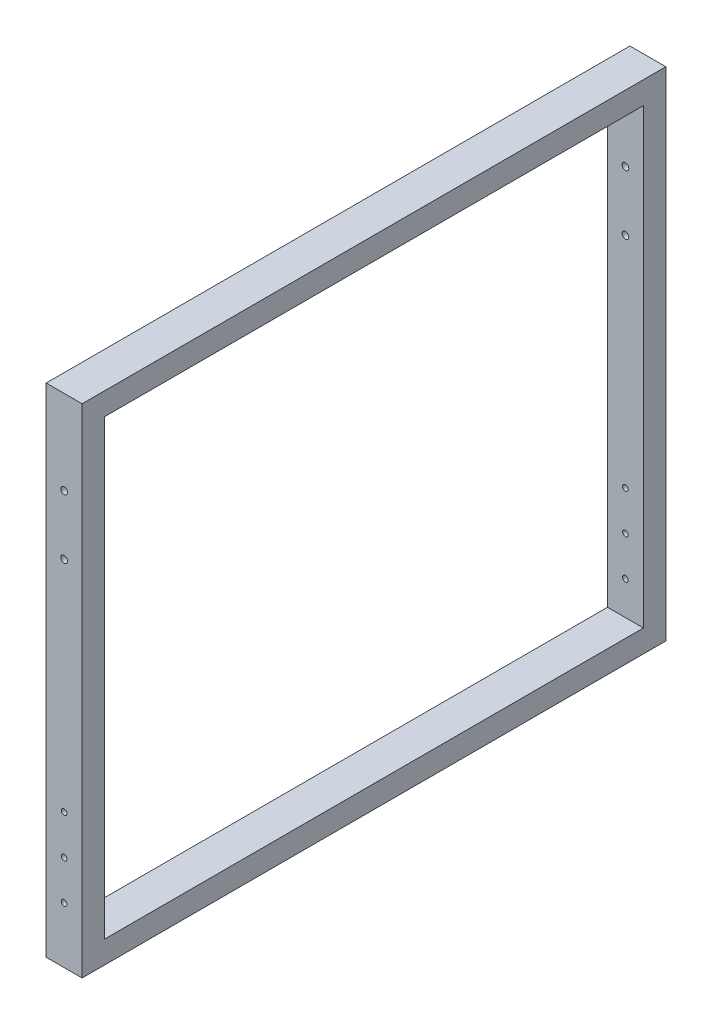
ISO-10303-21;
HEADER;
FILE_DESCRIPTION(('STEP AP214'),'2;1');
FILE_NAME('part.step','',(''),(''),'','','');
FILE_SCHEMA(('AUTOMOTIVE_DESIGN { 1 0 10303 214 1 1 1 1 }'));
ENDSEC;
DATA;
#1=APPLICATION_CONTEXT('core data for automotive mechanical design processes');
#2=APPLICATION_PROTOCOL_DEFINITION('international standard','automotive_design',2000,#1);
#3=PRODUCT_CONTEXT('',#1,'mechanical');
#4=PRODUCT('Part','Part','',(#3));
#5=PRODUCT_RELATED_PRODUCT_CATEGORY('part','',(#4));
#6=PRODUCT_DEFINITION_FORMATION('','',#4);
#7=PRODUCT_DEFINITION_CONTEXT('part definition',#1,'design');
#8=PRODUCT_DEFINITION('design','',#6,#7);
#9=PRODUCT_DEFINITION_SHAPE('','',#8);
#10=(LENGTH_UNIT() NAMED_UNIT(*) SI_UNIT(.MILLI.,.METRE.));
#11=(NAMED_UNIT(*) PLANE_ANGLE_UNIT() SI_UNIT($,.RADIAN.));
#12=(NAMED_UNIT(*) SI_UNIT($,.STERADIAN.) SOLID_ANGLE_UNIT());
#13=UNCERTAINTY_MEASURE_WITH_UNIT(LENGTH_MEASURE(1.E-05),#10,'distance_accuracy_value','');
#14=(GEOMETRIC_REPRESENTATION_CONTEXT(3) GLOBAL_UNCERTAINTY_ASSIGNED_CONTEXT((#13)) GLOBAL_UNIT_ASSIGNED_CONTEXT((#10,
#11,#12)) REPRESENTATION_CONTEXT('',''));
#15=CARTESIAN_POINT('',(0.,0.,0.));
#16=DIRECTION('',(0.,0.,1.));
#17=DIRECTION('',(1.,0.,0.));
#18=AXIS2_PLACEMENT_3D('',#15,#16,#17);
#19=CARTESIAN_POINT('',(32.,0.,0.));
#20=DIRECTION('',(-1.,0.,0.));
#21=DIRECTION('',(0.,0.,1.));
#22=AXIS2_PLACEMENT_3D('',#19,#20,#21);
#23=PLANE('',#22);
#24=DIRECTION('',(0.,1.,0.));
#25=VECTOR('',#24,1.);
#26=CARTESIAN_POINT('',(32.,221.5,-260.));
#27=LINE('',#26,#25);
#28=CARTESIAN_POINT('',(32.,-221.5,-260.));
#29=VERTEX_POINT('',#28);
#30=CARTESIAN_POINT('',(32.,221.5,-260.));
#31=VERTEX_POINT('',#30);
#32=EDGE_CURVE('E162',#29,#31,#27,.T.);
#33=ORIENTED_EDGE('',*,*,#32,.T.);
#34=DIRECTION('',(0.,0.,1.));
#35=VECTOR('',#34,1.);
#36=CARTESIAN_POINT('',(32.,221.5,-260.));
#37=LINE('',#36,#35);
#38=CARTESIAN_POINT('',(32.,221.5,260.));
#39=VERTEX_POINT('',#38);
#40=EDGE_CURVE('E166',#31,#39,#37,.T.);
#41=ORIENTED_EDGE('',*,*,#40,.T.);
#42=DIRECTION('',(0.,-1.,0.));
#43=VECTOR('',#42,1.);
#44=CARTESIAN_POINT('',(32.,221.5,260.));
#45=LINE('',#44,#43);
#46=CARTESIAN_POINT('',(32.,-221.5,260.));
#47=VERTEX_POINT('',#46);
#48=EDGE_CURVE('E170',#39,#47,#45,.T.);
#49=ORIENTED_EDGE('',*,*,#48,.T.);
#50=DIRECTION('',(0.,0.,-1.));
#51=VECTOR('',#50,1.);
#52=CARTESIAN_POINT('',(32.,-221.5,-260.));
#53=LINE('',#52,#51);
#54=EDGE_CURVE('E173',#47,#29,#53,.T.);
#55=ORIENTED_EDGE('',*,*,#54,.T.);
#56=EDGE_LOOP('',(#33,#41,#49,#55));
#57=FACE_BOUND('',#56,.T.);
#58=DIRECTION('',(0.,1.,0.));
#59=VECTOR('',#58,1.);
#60=CARTESIAN_POINT('',(32.,-201.5,-240.));
#61=LINE('',#60,#59);
#62=CARTESIAN_POINT('',(32.,-201.5,-240.));
#63=VERTEX_POINT('',#62);
#64=CARTESIAN_POINT('',(32.,201.5,-240.));
#65=VERTEX_POINT('',#64);
#66=EDGE_CURVE('E112',#63,#65,#61,.T.);
#67=ORIENTED_EDGE('',*,*,#66,.F.);
#68=DIRECTION('',(0.,0.,-1.));
#69=VECTOR('',#68,1.);
#70=CARTESIAN_POINT('',(32.,-201.5,240.));
#71=LINE('',#70,#69);
#72=CARTESIAN_POINT('',(32.,-201.5,240.));
#73=VERTEX_POINT('',#72);
#74=EDGE_CURVE('E138',#73,#63,#71,.T.);
#75=ORIENTED_EDGE('',*,*,#74,.F.);
#76=DIRECTION('',(0.,-1.,0.));
#77=VECTOR('',#76,1.);
#78=CARTESIAN_POINT('',(32.,-201.5,240.));
#79=LINE('',#78,#77);
#80=CARTESIAN_POINT('',(32.,201.5,240.));
#81=VERTEX_POINT('',#80);
#82=EDGE_CURVE('E134',#81,#73,#79,.T.);
#83=ORIENTED_EDGE('',*,*,#82,.F.);
#84=DIRECTION('',(0.,0.,1.));
#85=VECTOR('',#84,1.);
#86=CARTESIAN_POINT('',(32.,201.5,240.));
#87=LINE('',#86,#85);
#88=EDGE_CURVE('E121',#65,#81,#87,.T.);
#89=ORIENTED_EDGE('',*,*,#88,.F.);
#90=EDGE_LOOP('',(#67,#75,#83,#89));
#91=FACE_BOUND('',#90,.T.);
#92=ADVANCED_FACE('F44',(#57,#91),#23,.F.);
#93=CARTESIAN_POINT('',(0.,0.,0.));
#94=DIRECTION('',(-1.,0.,0.));
#95=DIRECTION('',(0.,0.,1.));
#96=AXIS2_PLACEMENT_3D('',#93,#94,#95);
#97=PLANE('',#96);
#98=DIRECTION('',(0.,1.,0.));
#99=VECTOR('',#98,1.);
#100=CARTESIAN_POINT('',(0.,221.5,-260.));
#101=LINE('',#100,#99);
#102=CARTESIAN_POINT('',(0.,-221.5,-260.));
#103=VERTEX_POINT('',#102);
#104=CARTESIAN_POINT('',(0.,221.5,-260.));
#105=VERTEX_POINT('',#104);
#106=EDGE_CURVE('E130',#103,#105,#101,.T.);
#107=ORIENTED_EDGE('',*,*,#106,.F.);
#108=DIRECTION('',(0.,0.,-1.));
#109=VECTOR('',#108,1.);
#110=CARTESIAN_POINT('',(0.,-221.5,-260.));
#111=LINE('',#110,#109);
#112=CARTESIAN_POINT('',(0.,-221.5,260.));
#113=VERTEX_POINT('',#112);
#114=EDGE_CURVE('E167',#113,#103,#111,.T.);
#115=ORIENTED_EDGE('',*,*,#114,.F.);
#116=DIRECTION('',(0.,-1.,0.));
#117=VECTOR('',#116,1.);
#118=CARTESIAN_POINT('',(0.,221.5,260.));
#119=LINE('',#118,#117);
#120=CARTESIAN_POINT('',(0.,221.5,260.));
#121=VERTEX_POINT('',#120);
#122=EDGE_CURVE('E183',#121,#113,#119,.T.);
#123=ORIENTED_EDGE('',*,*,#122,.F.);
#124=DIRECTION('',(0.,0.,1.));
#125=VECTOR('',#124,1.);
#126=CARTESIAN_POINT('',(0.,221.5,-260.));
#127=LINE('',#126,#125);
#128=EDGE_CURVE('E180',#105,#121,#127,.T.);
#129=ORIENTED_EDGE('',*,*,#128,.F.);
#130=EDGE_LOOP('',(#107,#115,#123,#129));
#131=FACE_BOUND('',#130,.T.);
#132=DIRECTION('',(0.,0.,-1.));
#133=VECTOR('',#132,1.);
#134=CARTESIAN_POINT('',(0.,-201.5,240.));
#135=LINE('',#134,#133);
#136=CARTESIAN_POINT('',(0.,-201.5,240.));
#137=VERTEX_POINT('',#136);
#138=CARTESIAN_POINT('',(0.,-201.5,-240.));
#139=VERTEX_POINT('',#138);
#140=EDGE_CURVE('E122',#137,#139,#135,.T.);
#141=ORIENTED_EDGE('',*,*,#140,.T.);
#142=DIRECTION('',(0.,1.,0.));
#143=VECTOR('',#142,1.);
#144=CARTESIAN_POINT('',(0.,-201.5,-240.));
#145=LINE('',#144,#143);
#146=CARTESIAN_POINT('',(0.,201.5,-240.));
#147=VERTEX_POINT('',#146);
#148=EDGE_CURVE('E70',#139,#147,#145,.T.);
#149=ORIENTED_EDGE('',*,*,#148,.T.);
#150=DIRECTION('',(0.,0.,1.));
#151=VECTOR('',#150,1.);
#152=CARTESIAN_POINT('',(0.,201.5,240.));
#153=LINE('',#152,#151);
#154=CARTESIAN_POINT('',(0.,201.5,240.));
#155=VERTEX_POINT('',#154);
#156=EDGE_CURVE('E128',#147,#155,#153,.T.);
#157=ORIENTED_EDGE('',*,*,#156,.T.);
#158=DIRECTION('',(0.,-1.,0.));
#159=VECTOR('',#158,1.);
#160=CARTESIAN_POINT('',(0.,-201.5,240.));
#161=LINE('',#160,#159);
#162=EDGE_CURVE('E149',#155,#137,#161,.T.);
#163=ORIENTED_EDGE('',*,*,#162,.T.);
#164=EDGE_LOOP('',(#141,#149,#157,#163));
#165=FACE_BOUND('',#164,.T.);
#166=ADVANCED_FACE('F299',(#131,#165),#97,.T.);
#167=CARTESIAN_POINT('',(32.,221.5,-260.));
#168=DIRECTION('',(0.,0.,1.));
#169=DIRECTION('',(1.,0.,0.));
#170=AXIS2_PLACEMENT_3D('',#167,#168,#169);
#171=PLANE('',#170);
#172=CARTESIAN_POINT('',(16.,146.5,-260.));
#173=DIRECTION('',(0.,0.,1.));
#174=DIRECTION('',(1.,0.,0.));
#175=AXIS2_PLACEMENT_3D('',#172,#173,#174);
#176=CIRCLE('',#175,3.);
#177=CARTESIAN_POINT('',(19.,146.5,-260.));
#178=VERTEX_POINT('',#177);
#179=EDGE_CURVE('E243',#178,#178,#176,.T.);
#180=ORIENTED_EDGE('',*,*,#179,.T.);
#181=EDGE_LOOP('',(#180));
#182=FACE_BOUND('',#181,.T.);
#183=CARTESIAN_POINT('',(16.,93.5,-260.));
#184=DIRECTION('',(0.,0.,1.));
#185=DIRECTION('',(1.,0.,0.));
#186=AXIS2_PLACEMENT_3D('',#183,#184,#185);
#187=CIRCLE('',#186,3.);
#188=CARTESIAN_POINT('',(19.,93.5,-260.));
#189=VERTEX_POINT('',#188);
#190=EDGE_CURVE('E229',#189,#189,#187,.T.);
#191=ORIENTED_EDGE('',*,*,#190,.T.);
#192=EDGE_LOOP('',(#191));
#193=FACE_BOUND('',#192,.T.);
#194=CARTESIAN_POINT('',(16.,-171.5,-260.));
#195=DIRECTION('',(0.,0.,1.));
#196=DIRECTION('',(1.,0.,0.));
#197=AXIS2_PLACEMENT_3D('',#194,#195,#196);
#198=CIRCLE('',#197,2.5);
#199=CARTESIAN_POINT('',(18.5,-171.5,-260.));
#200=VERTEX_POINT('',#199);
#201=EDGE_CURVE('E146',#200,#200,#198,.T.);
#202=ORIENTED_EDGE('',*,*,#201,.T.);
#203=EDGE_LOOP('',(#202));
#204=FACE_BOUND('',#203,.T.);
#205=CARTESIAN_POINT('',(16.,-136.5,-260.));
#206=DIRECTION('',(0.,0.,1.));
#207=DIRECTION('',(1.,0.,0.));
#208=AXIS2_PLACEMENT_3D('',#205,#206,#207);
#209=CIRCLE('',#208,2.5);
#210=CARTESIAN_POINT('',(18.5,-136.5,-260.));
#211=VERTEX_POINT('',#210);
#212=EDGE_CURVE('E214',#211,#211,#209,.T.);
#213=ORIENTED_EDGE('',*,*,#212,.T.);
#214=EDGE_LOOP('',(#213));
#215=FACE_BOUND('',#214,.T.);
#216=CARTESIAN_POINT('',(16.,-101.5,-260.));
#217=DIRECTION('',(0.,0.,1.));
#218=DIRECTION('',(1.,0.,0.));
#219=AXIS2_PLACEMENT_3D('',#216,#217,#218);
#220=CIRCLE('',#219,2.5);
#221=CARTESIAN_POINT('',(18.5,-101.5,-260.));
#222=VERTEX_POINT('',#221);
#223=EDGE_CURVE('E209',#222,#222,#220,.T.);
#224=ORIENTED_EDGE('',*,*,#223,.T.);
#225=EDGE_LOOP('',(#224));
#226=FACE_BOUND('',#225,.T.);
#227=ORIENTED_EDGE('',*,*,#106,.T.);
#228=DIRECTION('',(-1.,0.,0.));
#229=VECTOR('',#228,1.);
#230=CARTESIAN_POINT('',(32.,221.5,-260.));
#231=LINE('',#230,#229);
#232=EDGE_CURVE('E11',#31,#105,#231,.T.);
#233=ORIENTED_EDGE('',*,*,#232,.F.);
#234=ORIENTED_EDGE('',*,*,#32,.F.);
#235=DIRECTION('',(-1.,0.,0.));
#236=VECTOR('',#235,1.);
#237=CARTESIAN_POINT('',(32.,-221.5,-260.));
#238=LINE('',#237,#236);
#239=EDGE_CURVE('E176',#29,#103,#238,.T.);
#240=ORIENTED_EDGE('',*,*,#239,.T.);
#241=EDGE_LOOP('',(#227,#233,#234,#240));
#242=FACE_BOUND('',#241,.T.);
#243=ADVANCED_FACE('F46',(#182,#193,#204,#215,#226,#242),#171,.F.);
#244=CARTESIAN_POINT('',(32.,221.5,-260.));
#245=DIRECTION('',(0.,-1.,0.));
#246=DIRECTION('',(0.,0.,-1.));
#247=AXIS2_PLACEMENT_3D('',#244,#245,#246);
#248=PLANE('',#247);
#249=ORIENTED_EDGE('',*,*,#128,.T.);
#250=DIRECTION('',(-1.,0.,0.));
#251=VECTOR('',#250,1.);
#252=CARTESIAN_POINT('',(32.,221.5,260.));
#253=LINE('',#252,#251);
#254=EDGE_CURVE('E54',#39,#121,#253,.T.);
#255=ORIENTED_EDGE('',*,*,#254,.F.);
#256=ORIENTED_EDGE('',*,*,#40,.F.);
#257=ORIENTED_EDGE('',*,*,#232,.T.);
#258=EDGE_LOOP('',(#249,#255,#256,#257));
#259=FACE_BOUND('',#258,.T.);
#260=ADVANCED_FACE('F316',(#259),#248,.F.);
#261=CARTESIAN_POINT('',(32.,221.5,260.));
#262=DIRECTION('',(0.,0.,-1.));
#263=DIRECTION('',(-1.,0.,0.));
#264=AXIS2_PLACEMENT_3D('',#261,#262,#263);
#265=PLANE('',#264);
#266=CARTESIAN_POINT('',(16.,146.5,260.));
#267=DIRECTION('',(0.,0.,-1.));
#268=DIRECTION('',(-1.,0.,0.));
#269=AXIS2_PLACEMENT_3D('',#266,#267,#268);
#270=CIRCLE('',#269,3.);
#271=CARTESIAN_POINT('',(13.,146.5,260.));
#272=VERTEX_POINT('',#271);
#273=EDGE_CURVE('E239',#272,#272,#270,.T.);
#274=ORIENTED_EDGE('',*,*,#273,.T.);
#275=EDGE_LOOP('',(#274));
#276=FACE_BOUND('',#275,.T.);
#277=CARTESIAN_POINT('',(16.,93.5,260.));
#278=DIRECTION('',(0.,0.,-1.));
#279=DIRECTION('',(-1.,0.,0.));
#280=AXIS2_PLACEMENT_3D('',#277,#278,#279);
#281=CIRCLE('',#280,3.);
#282=CARTESIAN_POINT('',(13.,93.5,260.));
#283=VERTEX_POINT('',#282);
#284=EDGE_CURVE('E223',#283,#283,#281,.T.);
#285=ORIENTED_EDGE('',*,*,#284,.T.);
#286=EDGE_LOOP('',(#285));
#287=FACE_BOUND('',#286,.T.);
#288=CARTESIAN_POINT('',(16.,-171.5,260.));
#289=DIRECTION('',(0.,0.,1.));
#290=DIRECTION('',(1.,0.,0.));
#291=AXIS2_PLACEMENT_3D('',#288,#289,#290);
#292=CIRCLE('',#291,2.5);
#293=CARTESIAN_POINT('',(18.5,-171.5,260.));
#294=VERTEX_POINT('',#293);
#295=EDGE_CURVE('E203',#294,#294,#292,.T.);
#296=ORIENTED_EDGE('',*,*,#295,.F.);
#297=EDGE_LOOP('',(#296));
#298=FACE_BOUND('',#297,.T.);
#299=CARTESIAN_POINT('',(16.,-136.5,260.));
#300=DIRECTION('',(0.,0.,1.));
#301=DIRECTION('',(1.,0.,0.));
#302=AXIS2_PLACEMENT_3D('',#299,#300,#301);
#303=CIRCLE('',#302,2.5);
#304=CARTESIAN_POINT('',(18.5,-136.5,260.));
#305=VERTEX_POINT('',#304);
#306=EDGE_CURVE('E251',#305,#305,#303,.T.);
#307=ORIENTED_EDGE('',*,*,#306,.F.);
#308=EDGE_LOOP('',(#307));
#309=FACE_BOUND('',#308,.T.);
#310=CARTESIAN_POINT('',(16.,-101.5,260.));
#311=DIRECTION('',(0.,0.,1.));
#312=DIRECTION('',(1.,0.,0.));
#313=AXIS2_PLACEMENT_3D('',#310,#311,#312);
#314=CIRCLE('',#313,2.5);
#315=CARTESIAN_POINT('',(18.5,-101.5,260.));
#316=VERTEX_POINT('',#315);
#317=EDGE_CURVE('E247',#316,#316,#314,.T.);
#318=ORIENTED_EDGE('',*,*,#317,.F.);
#319=EDGE_LOOP('',(#318));
#320=FACE_BOUND('',#319,.T.);
#321=ORIENTED_EDGE('',*,*,#122,.T.);
#322=DIRECTION('',(-1.,0.,0.));
#323=VECTOR('',#322,1.);
#324=CARTESIAN_POINT('',(32.,-221.5,260.));
#325=LINE('',#324,#323);
#326=EDGE_CURVE('E191',#47,#113,#325,.T.);
#327=ORIENTED_EDGE('',*,*,#326,.F.);
#328=ORIENTED_EDGE('',*,*,#48,.F.);
#329=ORIENTED_EDGE('',*,*,#254,.T.);
#330=EDGE_LOOP('',(#321,#327,#328,#329));
#331=FACE_BOUND('',#330,.T.);
#332=ADVANCED_FACE('F313',(#276,#287,#298,#309,#320,#331),#265,.F.);
#333=CARTESIAN_POINT('',(32.,-221.5,-260.));
#334=DIRECTION('',(0.,1.,0.));
#335=DIRECTION('',(0.,0.,1.));
#336=AXIS2_PLACEMENT_3D('',#333,#334,#335);
#337=PLANE('',#336);
#338=ORIENTED_EDGE('',*,*,#114,.T.);
#339=ORIENTED_EDGE('',*,*,#239,.F.);
#340=ORIENTED_EDGE('',*,*,#54,.F.);
#341=ORIENTED_EDGE('',*,*,#326,.T.);
#342=EDGE_LOOP('',(#338,#339,#340,#341));
#343=FACE_BOUND('',#342,.T.);
#344=ADVANCED_FACE('F310',(#343),#337,.F.);
#345=CARTESIAN_POINT('',(32.,-201.5,-240.));
#346=DIRECTION('',(0.,0.,1.));
#347=DIRECTION('',(0.,-1.,0.));
#348=AXIS2_PLACEMENT_3D('',#345,#346,#347);
#349=PLANE('',#348);
#350=CARTESIAN_POINT('',(16.,146.5,-240.));
#351=DIRECTION('',(0.,0.,1.));
#352=DIRECTION('',(0.,-1.,0.));
#353=AXIS2_PLACEMENT_3D('',#350,#351,#352);
#354=CIRCLE('',#353,3.);
#355=CARTESIAN_POINT('',(16.,143.5,-240.));
#356=VERTEX_POINT('',#355);
#357=EDGE_CURVE('E235',#356,#356,#354,.T.);
#358=ORIENTED_EDGE('',*,*,#357,.F.);
#359=EDGE_LOOP('',(#358));
#360=FACE_BOUND('',#359,.T.);
#361=CARTESIAN_POINT('',(16.,93.5,-240.));
#362=DIRECTION('',(0.,0.,1.));
#363=DIRECTION('',(0.,-1.,0.));
#364=AXIS2_PLACEMENT_3D('',#361,#362,#363);
#365=CIRCLE('',#364,3.);
#366=CARTESIAN_POINT('',(16.,90.5,-240.));
#367=VERTEX_POINT('',#366);
#368=EDGE_CURVE('E218',#367,#367,#365,.T.);
#369=ORIENTED_EDGE('',*,*,#368,.F.);
#370=EDGE_LOOP('',(#369));
#371=FACE_BOUND('',#370,.T.);
#372=CARTESIAN_POINT('',(16.,-171.5,-240.));
#373=DIRECTION('',(0.,0.,1.));
#374=DIRECTION('',(0.,-1.,0.));
#375=AXIS2_PLACEMENT_3D('',#372,#373,#374);
#376=CIRCLE('',#375,2.5);
#377=CARTESIAN_POINT('',(16.,-174.,-240.));
#378=VERTEX_POINT('',#377);
#379=EDGE_CURVE('E213',#378,#378,#376,.T.);
#380=ORIENTED_EDGE('',*,*,#379,.F.);
#381=EDGE_LOOP('',(#380));
#382=FACE_BOUND('',#381,.T.);
#383=CARTESIAN_POINT('',(16.,-136.5,-240.));
#384=DIRECTION('',(0.,0.,1.));
#385=DIRECTION('',(0.,-1.,0.));
#386=AXIS2_PLACEMENT_3D('',#383,#384,#385);
#387=CIRCLE('',#386,2.5);
#388=CARTESIAN_POINT('',(16.,-139.,-240.));
#389=VERTEX_POINT('',#388);
#390=EDGE_CURVE('E208',#389,#389,#387,.T.);
#391=ORIENTED_EDGE('',*,*,#390,.F.);
#392=EDGE_LOOP('',(#391));
#393=FACE_BOUND('',#392,.T.);
#394=CARTESIAN_POINT('',(16.,-101.5,-240.));
#395=DIRECTION('',(0.,0.,1.));
#396=DIRECTION('',(0.,-1.,0.));
#397=AXIS2_PLACEMENT_3D('',#394,#395,#396);
#398=CIRCLE('',#397,2.5);
#399=CARTESIAN_POINT('',(16.,-104.,-240.));
#400=VERTEX_POINT('',#399);
#401=EDGE_CURVE('E202',#400,#400,#398,.T.);
#402=ORIENTED_EDGE('',*,*,#401,.F.);
#403=EDGE_LOOP('',(#402));
#404=FACE_BOUND('',#403,.T.);
#405=ORIENTED_EDGE('',*,*,#148,.F.);
#406=DIRECTION('',(-1.,0.,0.));
#407=VECTOR('',#406,1.);
#408=CARTESIAN_POINT('',(32.,-201.5,-240.));
#409=LINE('',#408,#407);
#410=EDGE_CURVE('E116',#63,#139,#409,.T.);
#411=ORIENTED_EDGE('',*,*,#410,.F.);
#412=ORIENTED_EDGE('',*,*,#66,.T.);
#413=DIRECTION('',(-1.,0.,0.));
#414=VECTOR('',#413,1.);
#415=CARTESIAN_POINT('',(32.,201.5,-240.));
#416=LINE('',#415,#414);
#417=EDGE_CURVE('E115',#65,#147,#416,.T.);
#418=ORIENTED_EDGE('',*,*,#417,.T.);
#419=EDGE_LOOP('',(#405,#411,#412,#418));
#420=FACE_BOUND('',#419,.T.);
#421=ADVANCED_FACE('F114',(#360,#371,#382,#393,#404,#420),#349,.T.);
#422=CARTESIAN_POINT('',(32.,201.5,240.));
#423=DIRECTION('',(0.,-1.,0.));
#424=DIRECTION('',(0.,0.,-1.));
#425=AXIS2_PLACEMENT_3D('',#422,#423,#424);
#426=PLANE('',#425);
#427=ORIENTED_EDGE('',*,*,#156,.F.);
#428=ORIENTED_EDGE('',*,*,#417,.F.);
#429=ORIENTED_EDGE('',*,*,#88,.T.);
#430=DIRECTION('',(-1.,0.,0.));
#431=VECTOR('',#430,1.);
#432=CARTESIAN_POINT('',(32.,201.5,240.));
#433=LINE('',#432,#431);
#434=EDGE_CURVE('E131',#81,#155,#433,.T.);
#435=ORIENTED_EDGE('',*,*,#434,.T.);
#436=EDGE_LOOP('',(#427,#428,#429,#435));
#437=FACE_BOUND('',#436,.T.);
#438=ADVANCED_FACE('F125',(#437),#426,.T.);
#439=CARTESIAN_POINT('',(32.,-201.5,240.));
#440=DIRECTION('',(0.,0.,-1.));
#441=DIRECTION('',(-1.,0.,0.));
#442=AXIS2_PLACEMENT_3D('',#439,#440,#441);
#443=PLANE('',#442);
#444=CARTESIAN_POINT('',(16.,146.5,240.));
#445=DIRECTION('',(0.,0.,-1.));
#446=DIRECTION('',(-1.,0.,0.));
#447=AXIS2_PLACEMENT_3D('',#444,#445,#446);
#448=CIRCLE('',#447,3.);
#449=CARTESIAN_POINT('',(13.,146.5,240.));
#450=VERTEX_POINT('',#449);
#451=EDGE_CURVE('E48',#450,#450,#448,.T.);
#452=ORIENTED_EDGE('',*,*,#451,.F.);
#453=EDGE_LOOP('',(#452));
#454=FACE_BOUND('',#453,.T.);
#455=CARTESIAN_POINT('',(16.,93.5,240.));
#456=DIRECTION('',(0.,0.,-1.));
#457=DIRECTION('',(-1.,0.,0.));
#458=AXIS2_PLACEMENT_3D('',#455,#456,#457);
#459=CIRCLE('',#458,3.);
#460=CARTESIAN_POINT('',(13.,93.5,240.));
#461=VERTEX_POINT('',#460);
#462=EDGE_CURVE('E215',#461,#461,#459,.T.);
#463=ORIENTED_EDGE('',*,*,#462,.F.);
#464=EDGE_LOOP('',(#463));
#465=FACE_BOUND('',#464,.T.);
#466=CARTESIAN_POINT('',(16.,-171.5,240.));
#467=DIRECTION('',(0.,0.,-1.));
#468=DIRECTION('',(-1.,0.,0.));
#469=AXIS2_PLACEMENT_3D('',#466,#467,#468);
#470=CIRCLE('',#469,2.5);
#471=CARTESIAN_POINT('',(13.5,-171.5,240.));
#472=VERTEX_POINT('',#471);
#473=EDGE_CURVE('E210',#472,#472,#470,.T.);
#474=ORIENTED_EDGE('',*,*,#473,.F.);
#475=EDGE_LOOP('',(#474));
#476=FACE_BOUND('',#475,.T.);
#477=CARTESIAN_POINT('',(16.,-136.5,240.));
#478=DIRECTION('',(0.,0.,-1.));
#479=DIRECTION('',(-1.,0.,0.));
#480=AXIS2_PLACEMENT_3D('',#477,#478,#479);
#481=CIRCLE('',#480,2.5);
#482=CARTESIAN_POINT('',(13.5,-136.5,240.));
#483=VERTEX_POINT('',#482);
#484=EDGE_CURVE('E204',#483,#483,#481,.T.);
#485=ORIENTED_EDGE('',*,*,#484,.F.);
#486=EDGE_LOOP('',(#485));
#487=FACE_BOUND('',#486,.T.);
#488=CARTESIAN_POINT('',(16.,-101.5,240.));
#489=DIRECTION('',(0.,0.,-1.));
#490=DIRECTION('',(-1.,0.,0.));
#491=AXIS2_PLACEMENT_3D('',#488,#489,#490);
#492=CIRCLE('',#491,2.5);
#493=CARTESIAN_POINT('',(13.5,-101.5,240.));
#494=VERTEX_POINT('',#493);
#495=EDGE_CURVE('E198',#494,#494,#492,.T.);
#496=ORIENTED_EDGE('',*,*,#495,.F.);
#497=EDGE_LOOP('',(#496));
#498=FACE_BOUND('',#497,.T.);
#499=ORIENTED_EDGE('',*,*,#162,.F.);
#500=ORIENTED_EDGE('',*,*,#434,.F.);
#501=ORIENTED_EDGE('',*,*,#82,.T.);
#502=DIRECTION('',(-1.,0.,0.));
#503=VECTOR('',#502,1.);
#504=CARTESIAN_POINT('',(32.,-201.5,240.));
#505=LINE('',#504,#503);
#506=EDGE_CURVE('E62',#73,#137,#505,.T.);
#507=ORIENTED_EDGE('',*,*,#506,.T.);
#508=EDGE_LOOP('',(#499,#500,#501,#507));
#509=FACE_BOUND('',#508,.T.);
#510=ADVANCED_FACE('F341',(#454,#465,#476,#487,#498,#509),#443,.T.);
#511=CARTESIAN_POINT('',(32.,-201.5,240.));
#512=DIRECTION('',(0.,1.,0.));
#513=DIRECTION('',(0.,0.,1.));
#514=AXIS2_PLACEMENT_3D('',#511,#512,#513);
#515=PLANE('',#514);
#516=ORIENTED_EDGE('',*,*,#140,.F.);
#517=ORIENTED_EDGE('',*,*,#506,.F.);
#518=ORIENTED_EDGE('',*,*,#74,.T.);
#519=ORIENTED_EDGE('',*,*,#410,.T.);
#520=EDGE_LOOP('',(#516,#517,#518,#519));
#521=FACE_BOUND('',#520,.T.);
#522=ADVANCED_FACE('F338',(#521),#515,.T.);
#523=CARTESIAN_POINT('',(16.,-101.5,-350.));
#524=DIRECTION('',(0.,0.,1.));
#525=DIRECTION('',(1.,0.,0.));
#526=AXIS2_PLACEMENT_3D('',#523,#524,#525);
#527=CYLINDRICAL_SURFACE('',#526,2.5);
#528=ORIENTED_EDGE('',*,*,#495,.T.);
#529=EDGE_LOOP('',(#528));
#530=FACE_BOUND('',#529,.T.);
#531=ORIENTED_EDGE('',*,*,#317,.T.);
#532=EDGE_LOOP('',(#531));
#533=FACE_BOUND('',#532,.T.);
#534=ADVANCED_FACE('F340',(#530,#533),#527,.F.);
#535=CARTESIAN_POINT('',(16.,-136.5,-350.));
#536=DIRECTION('',(0.,0.,1.));
#537=DIRECTION('',(1.,0.,0.));
#538=AXIS2_PLACEMENT_3D('',#535,#536,#537);
#539=CYLINDRICAL_SURFACE('',#538,2.5);
#540=ORIENTED_EDGE('',*,*,#484,.T.);
#541=EDGE_LOOP('',(#540));
#542=FACE_BOUND('',#541,.T.);
#543=ORIENTED_EDGE('',*,*,#306,.T.);
#544=EDGE_LOOP('',(#543));
#545=FACE_BOUND('',#544,.T.);
#546=ADVANCED_FACE('F295',(#542,#545),#539,.F.);
#547=CARTESIAN_POINT('',(16.,-171.5,-350.));
#548=DIRECTION('',(0.,0.,1.));
#549=DIRECTION('',(1.,0.,0.));
#550=AXIS2_PLACEMENT_3D('',#547,#548,#549);
#551=CYLINDRICAL_SURFACE('',#550,2.5);
#552=ORIENTED_EDGE('',*,*,#473,.T.);
#553=EDGE_LOOP('',(#552));
#554=FACE_BOUND('',#553,.T.);
#555=ORIENTED_EDGE('',*,*,#295,.T.);
#556=EDGE_LOOP('',(#555));
#557=FACE_BOUND('',#556,.T.);
#558=ADVANCED_FACE('F284',(#554,#557),#551,.F.);
#559=ORIENTED_EDGE('',*,*,#401,.T.);
#560=EDGE_LOOP('',(#559));
#561=FACE_BOUND('',#560,.T.);
#562=ORIENTED_EDGE('',*,*,#223,.F.);
#563=EDGE_LOOP('',(#562));
#564=FACE_BOUND('',#563,.T.);
#565=ADVANCED_FACE('F292',(#561,#564),#527,.F.);
#566=ORIENTED_EDGE('',*,*,#390,.T.);
#567=EDGE_LOOP('',(#566));
#568=FACE_BOUND('',#567,.T.);
#569=ORIENTED_EDGE('',*,*,#212,.F.);
#570=EDGE_LOOP('',(#569));
#571=FACE_BOUND('',#570,.T.);
#572=ADVANCED_FACE('F281',(#568,#571),#539,.F.);
#573=ORIENTED_EDGE('',*,*,#379,.T.);
#574=EDGE_LOOP('',(#573));
#575=FACE_BOUND('',#574,.T.);
#576=ORIENTED_EDGE('',*,*,#201,.F.);
#577=EDGE_LOOP('',(#576));
#578=FACE_BOUND('',#577,.T.);
#579=ADVANCED_FACE('F278',(#575,#578),#551,.F.);
#580=CARTESIAN_POINT('',(16.,93.5,345.));
#581=DIRECTION('',(0.,0.,-1.));
#582=DIRECTION('',(-1.,0.,0.));
#583=AXIS2_PLACEMENT_3D('',#580,#581,#582);
#584=CYLINDRICAL_SURFACE('',#583,3.);
#585=ORIENTED_EDGE('',*,*,#462,.T.);
#586=EDGE_LOOP('',(#585));
#587=FACE_BOUND('',#586,.T.);
#588=ORIENTED_EDGE('',*,*,#284,.F.);
#589=EDGE_LOOP('',(#588));
#590=FACE_BOUND('',#589,.T.);
#591=ADVANCED_FACE('F280',(#587,#590),#584,.F.);
#592=CARTESIAN_POINT('',(16.,146.5,345.));
#593=DIRECTION('',(0.,0.,-1.));
#594=DIRECTION('',(-1.,0.,0.));
#595=AXIS2_PLACEMENT_3D('',#592,#593,#594);
#596=CYLINDRICAL_SURFACE('',#595,3.);
#597=ORIENTED_EDGE('',*,*,#451,.T.);
#598=EDGE_LOOP('',(#597));
#599=FACE_BOUND('',#598,.T.);
#600=ORIENTED_EDGE('',*,*,#273,.F.);
#601=EDGE_LOOP('',(#600));
#602=FACE_BOUND('',#601,.T.);
#603=ADVANCED_FACE('F289',(#599,#602),#596,.F.);
#604=ORIENTED_EDGE('',*,*,#368,.T.);
#605=EDGE_LOOP('',(#604));
#606=FACE_BOUND('',#605,.T.);
#607=ORIENTED_EDGE('',*,*,#190,.F.);
#608=EDGE_LOOP('',(#607));
#609=FACE_BOUND('',#608,.T.);
#610=ADVANCED_FACE('F291',(#606,#609),#584,.F.);
#611=ORIENTED_EDGE('',*,*,#357,.T.);
#612=EDGE_LOOP('',(#611));
#613=FACE_BOUND('',#612,.T.);
#614=ORIENTED_EDGE('',*,*,#179,.F.);
#615=EDGE_LOOP('',(#614));
#616=FACE_BOUND('',#615,.T.);
#617=ADVANCED_FACE('F403',(#613,#616),#596,.F.);
#618=CLOSED_SHELL('',(#92,#166,#243,#260,#332,#344,#421,#438,#510,#522,#534,#546,#558,#565,#572,
#579,#591,#603,#610,#617));
#619=MANIFOLD_SOLID_BREP('B2',#618);
#620=ADVANCED_BREP_SHAPE_REPRESENTATION('',(#18,#619),#14);
#621=SHAPE_DEFINITION_REPRESENTATION(#9,#620);
ENDSEC;
END-ISO-10303-21;
